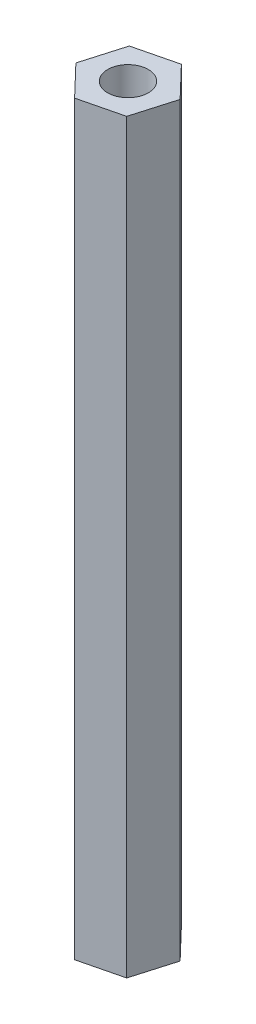
ISO-10303-21;
HEADER;
FILE_DESCRIPTION(('STEP AP214'),'2;1');
FILE_NAME('part.step','',(''),(''),'','','');
FILE_SCHEMA(('AUTOMOTIVE_DESIGN { 1 0 10303 214 1 1 1 1 }'));
ENDSEC;
DATA;
#1=APPLICATION_CONTEXT('core data for automotive mechanical design processes');
#2=APPLICATION_PROTOCOL_DEFINITION('international standard','automotive_design',2000,#1);
#3=PRODUCT_CONTEXT('',#1,'mechanical');
#4=PRODUCT('Part','Part','',(#3));
#5=PRODUCT_RELATED_PRODUCT_CATEGORY('part','',(#4));
#6=PRODUCT_DEFINITION_FORMATION('','',#4);
#7=PRODUCT_DEFINITION_CONTEXT('part definition',#1,'design');
#8=PRODUCT_DEFINITION('design','',#6,#7);
#9=PRODUCT_DEFINITION_SHAPE('','',#8);
#10=(LENGTH_UNIT() NAMED_UNIT(*) SI_UNIT(.MILLI.,.METRE.));
#11=(NAMED_UNIT(*) PLANE_ANGLE_UNIT() SI_UNIT($,.RADIAN.));
#12=(NAMED_UNIT(*) SI_UNIT($,.STERADIAN.) SOLID_ANGLE_UNIT());
#13=UNCERTAINTY_MEASURE_WITH_UNIT(LENGTH_MEASURE(1.E-05),#10,'distance_accuracy_value','');
#14=(GEOMETRIC_REPRESENTATION_CONTEXT(3) GLOBAL_UNCERTAINTY_ASSIGNED_CONTEXT((#13)) GLOBAL_UNIT_ASSIGNED_CONTEXT((#10,
#11,#12)) REPRESENTATION_CONTEXT('',''));
#15=CARTESIAN_POINT('',(0.,0.,0.));
#16=DIRECTION('',(0.,0.,1.));
#17=DIRECTION('',(1.,0.,0.));
#18=AXIS2_PLACEMENT_3D('',#15,#16,#17);
#19=CARTESIAN_POINT('',(-6.32811130994487,63.5,-2.46052037020981));
#20=DIRECTION('',(-0.238502387947703,0.,-0.971141910815944));
#21=DIRECTION('',(-0.971141910815944,0.,0.238502387947703));
#22=AXIS2_PLACEMENT_3D('',#19,#20,#21);
#23=PLANE('',#22);
#24=DIRECTION('',(0.971141910815944,0.,-0.238502387947703));
#25=VECTOR('',#24,1.);
#26=CARTESIAN_POINT('',(-6.32811130994487,0.,-2.46052037020981));
#27=LINE('',#26,#25);
#28=CARTESIAN_POINT('',(-6.32811130994487,0.,-2.46052037020981));
#29=VERTEX_POINT('',#28);
#30=CARTESIAN_POINT('',(-2.76773588288857,0.,-3.33491167377304));
#31=VERTEX_POINT('',#30);
#32=EDGE_CURVE('E122',#29,#31,#27,.T.);
#33=ORIENTED_EDGE('',*,*,#32,.T.);
#34=DIRECTION('',(0.,-1.,0.));
#35=VECTOR('',#34,1.);
#36=CARTESIAN_POINT('',(-2.76773588288857,63.5,-3.33491167377304));
#37=LINE('',#36,#35);
#38=CARTESIAN_POINT('',(-2.76773588288857,63.5,-3.33491167377304));
#39=VERTEX_POINT('',#38);
#40=EDGE_CURVE('E11',#39,#31,#37,.T.);
#41=ORIENTED_EDGE('',*,*,#40,.F.);
#42=DIRECTION('',(0.971141910815944,0.,-0.238502387947703));
#43=VECTOR('',#42,1.);
#44=CARTESIAN_POINT('',(-6.32811130994487,63.5,-2.46052037020981));
#45=LINE('',#44,#43);
#46=CARTESIAN_POINT('',(-6.32811130994487,63.5,-2.46052037020981));
#47=VERTEX_POINT('',#46);
#48=EDGE_CURVE('E133',#47,#39,#45,.T.);
#49=ORIENTED_EDGE('',*,*,#48,.F.);
#50=DIRECTION('',(0.,-1.,0.));
#51=VECTOR('',#50,1.);
#52=CARTESIAN_POINT('',(-6.32811130994487,63.5,-2.46052037020981));
#53=LINE('',#52,#51);
#54=EDGE_CURVE('E118',#47,#29,#53,.T.);
#55=ORIENTED_EDGE('',*,*,#54,.T.);
#56=EDGE_LOOP('',(#33,#41,#49,#55));
#57=FACE_BOUND('',#56,.T.);
#58=ADVANCED_FACE('F38',(#57),#23,.F.);
#59=CARTESIAN_POINT('',(-2.76773588288857,63.5,-3.33491167377304));
#60=DIRECTION('',(-0.960284759420221,0.,-0.279021828582011));
#61=DIRECTION('',(-0.279021828582011,0.,0.960284759420221));
#62=AXIS2_PLACEMENT_3D('',#59,#60,#61);
#63=PLANE('',#62);
#64=DIRECTION('',(0.279021828582011,0.,-0.960284759420221));
#65=VECTOR('',#64,1.);
#66=CARTESIAN_POINT('',(-2.76773588288857,0.,-3.33491167377304));
#67=LINE('',#66,#65);
#68=CARTESIAN_POINT('',(-1.74479325109438,0.,-6.85548289239529));
#69=VERTEX_POINT('',#68);
#70=EDGE_CURVE('E125',#31,#69,#67,.T.);
#71=ORIENTED_EDGE('',*,*,#70,.T.);
#72=DIRECTION('',(0.,-1.,0.));
#73=VECTOR('',#72,1.);
#74=CARTESIAN_POINT('',(-1.74479325109438,63.5,-6.85548289239529));
#75=LINE('',#74,#73);
#76=CARTESIAN_POINT('',(-1.74479325109438,63.5,-6.85548289239529));
#77=VERTEX_POINT('',#76);
#78=EDGE_CURVE('E46',#77,#69,#75,.T.);
#79=ORIENTED_EDGE('',*,*,#78,.F.);
#80=DIRECTION('',(0.279021828582011,0.,-0.960284759420221));
#81=VECTOR('',#80,1.);
#82=CARTESIAN_POINT('',(-2.76773588288857,63.5,-3.33491167377304));
#83=LINE('',#82,#81);
#84=EDGE_CURVE('E91',#39,#77,#83,.T.);
#85=ORIENTED_EDGE('',*,*,#84,.F.);
#86=ORIENTED_EDGE('',*,*,#40,.T.);
#87=EDGE_LOOP('',(#71,#79,#85,#86));
#88=FACE_BOUND('',#87,.T.);
#89=ADVANCED_FACE('F158',(#88),#63,.F.);
#90=CARTESIAN_POINT('',(-1.74479325109438,63.5,-6.85548289239529));
#91=DIRECTION('',(-0.721782371472518,0.,0.692120082233934));
#92=DIRECTION('',(0.692120082233934,0.,0.721782371472518));
#93=AXIS2_PLACEMENT_3D('',#90,#91,#92);
#94=PLANE('',#93);
#95=DIRECTION('',(-0.692120082233934,0.,-0.721782371472518));
#96=VECTOR('',#95,1.);
#97=CARTESIAN_POINT('',(-1.74479325109438,0.,-6.85548289239529));
#98=LINE('',#97,#96);
#99=CARTESIAN_POINT('',(-4.28222604635648,0.,-9.50166280745429));
#100=VERTEX_POINT('',#99);
#101=EDGE_CURVE('E128',#69,#100,#98,.T.);
#102=ORIENTED_EDGE('',*,*,#101,.T.);
#103=DIRECTION('',(0.,-1.,0.));
#104=VECTOR('',#103,1.);
#105=CARTESIAN_POINT('',(-4.28222604635648,63.5,-9.50166280745429));
#106=LINE('',#105,#104);
#107=CARTESIAN_POINT('',(-4.28222604635648,63.5,-9.50166280745429));
#108=VERTEX_POINT('',#107);
#109=EDGE_CURVE('E113',#108,#100,#106,.T.);
#110=ORIENTED_EDGE('',*,*,#109,.F.);
#111=DIRECTION('',(-0.692120082233934,0.,-0.721782371472518));
#112=VECTOR('',#111,1.);
#113=CARTESIAN_POINT('',(-1.74479325109438,63.5,-6.85548289239529));
#114=LINE('',#113,#112);
#115=EDGE_CURVE('E104',#77,#108,#114,.T.);
#116=ORIENTED_EDGE('',*,*,#115,.F.);
#117=ORIENTED_EDGE('',*,*,#78,.T.);
#118=EDGE_LOOP('',(#102,#110,#116,#117));
#119=FACE_BOUND('',#118,.T.);
#120=ADVANCED_FACE('F139',(#119),#94,.F.);
#121=CARTESIAN_POINT('',(-4.28222604635648,63.5,-9.50166280745429));
#122=DIRECTION('',(0.238502387947701,0.,0.971141910815944));
#123=DIRECTION('',(0.971141910815945,0.,-0.238502387947701));
#124=AXIS2_PLACEMENT_3D('',#121,#122,#123);
#125=PLANE('',#124);
#126=DIRECTION('',(-0.971141910815945,0.,0.238502387947701));
#127=VECTOR('',#126,1.);
#128=CARTESIAN_POINT('',(-4.28222604635648,0.,-9.50166280745429));
#129=LINE('',#128,#127);
#130=CARTESIAN_POINT('',(-7.84260147341278,0.,-8.62727150389105));
#131=VERTEX_POINT('',#130);
#132=EDGE_CURVE('E112',#100,#131,#129,.T.);
#133=ORIENTED_EDGE('',*,*,#132,.T.);
#134=DIRECTION('',(0.,-1.,0.));
#135=VECTOR('',#134,1.);
#136=CARTESIAN_POINT('',(-7.84260147341278,63.5,-8.62727150389105));
#137=LINE('',#136,#135);
#138=CARTESIAN_POINT('',(-7.84260147341278,63.5,-8.62727150389105));
#139=VERTEX_POINT('',#138);
#140=EDGE_CURVE('E109',#139,#131,#137,.T.);
#141=ORIENTED_EDGE('',*,*,#140,.F.);
#142=DIRECTION('',(-0.971141910815945,0.,0.238502387947701));
#143=VECTOR('',#142,1.);
#144=CARTESIAN_POINT('',(-4.28222604635648,63.5,-9.50166280745429));
#145=LINE('',#144,#143);
#146=EDGE_CURVE('E98',#108,#139,#145,.T.);
#147=ORIENTED_EDGE('',*,*,#146,.F.);
#148=ORIENTED_EDGE('',*,*,#109,.T.);
#149=EDGE_LOOP('',(#133,#141,#147,#148));
#150=FACE_BOUND('',#149,.T.);
#151=ADVANCED_FACE('F110',(#150),#125,.F.);
#152=CARTESIAN_POINT('',(-7.84260147341278,63.5,-8.62727150389105));
#153=DIRECTION('',(0.960284759420221,0.,0.27902182858201));
#154=DIRECTION('',(0.27902182858201,0.,-0.960284759420221));
#155=AXIS2_PLACEMENT_3D('',#152,#153,#154);
#156=PLANE('',#155);
#157=DIRECTION('',(-0.27902182858201,0.,0.960284759420221));
#158=VECTOR('',#157,1.);
#159=CARTESIAN_POINT('',(-7.84260147341278,0.,-8.62727150389105));
#160=LINE('',#159,#158);
#161=CARTESIAN_POINT('',(-8.86554410520697,0.,-5.10670028526881));
#162=VERTEX_POINT('',#161);
#163=EDGE_CURVE('E77',#131,#162,#160,.T.);
#164=ORIENTED_EDGE('',*,*,#163,.T.);
#165=DIRECTION('',(0.,-1.,0.));
#166=VECTOR('',#165,1.);
#167=CARTESIAN_POINT('',(-8.86554410520697,63.5,-5.10670028526881));
#168=LINE('',#167,#166);
#169=CARTESIAN_POINT('',(-8.86554410520697,63.5,-5.10670028526881));
#170=VERTEX_POINT('',#169);
#171=EDGE_CURVE('E114',#170,#162,#168,.T.);
#172=ORIENTED_EDGE('',*,*,#171,.F.);
#173=DIRECTION('',(-0.27902182858201,0.,0.960284759420221));
#174=VECTOR('',#173,1.);
#175=CARTESIAN_POINT('',(-7.84260147341278,63.5,-8.62727150389105));
#176=LINE('',#175,#174);
#177=EDGE_CURVE('E102',#139,#170,#176,.T.);
#178=ORIENTED_EDGE('',*,*,#177,.F.);
#179=ORIENTED_EDGE('',*,*,#140,.T.);
#180=EDGE_LOOP('',(#164,#172,#178,#179));
#181=FACE_BOUND('',#180,.T.);
#182=ADVANCED_FACE('F116',(#181),#156,.F.);
#183=CARTESIAN_POINT('',(-8.86554410520697,63.5,-5.10670028526881));
#184=DIRECTION('',(0.721782371472518,0.,-0.692120082233934));
#185=DIRECTION('',(-0.692120082233934,0.,-0.721782371472518));
#186=AXIS2_PLACEMENT_3D('',#183,#184,#185);
#187=PLANE('',#186);
#188=DIRECTION('',(0.692120082233934,0.,0.721782371472518));
#189=VECTOR('',#188,1.);
#190=CARTESIAN_POINT('',(-8.86554410520697,0.,-5.10670028526881));
#191=LINE('',#190,#189);
#192=EDGE_CURVE('E83',#162,#29,#191,.T.);
#193=ORIENTED_EDGE('',*,*,#192,.T.);
#194=ORIENTED_EDGE('',*,*,#54,.F.);
#195=DIRECTION('',(0.692120082233934,0.,0.721782371472518));
#196=VECTOR('',#195,1.);
#197=CARTESIAN_POINT('',(-8.86554410520697,63.5,-5.10670028526881));
#198=LINE('',#197,#196);
#199=EDGE_CURVE('E54',#170,#47,#198,.T.);
#200=ORIENTED_EDGE('',*,*,#199,.F.);
#201=ORIENTED_EDGE('',*,*,#171,.T.);
#202=EDGE_LOOP('',(#193,#194,#200,#201));
#203=FACE_BOUND('',#202,.T.);
#204=ADVANCED_FACE('F146',(#203),#187,.F.);
#205=CARTESIAN_POINT('',(0.,63.5,0.));
#206=DIRECTION('',(0.,1.,0.));
#207=DIRECTION('',(0.,0.,1.));
#208=AXIS2_PLACEMENT_3D('',#205,#206,#207);
#209=PLANE('',#208);
#210=CARTESIAN_POINT('',(-5.30516867815067,63.5,-5.98109158883205));
#211=DIRECTION('',(0.,1.,0.));
#212=DIRECTION('',(0.,0.,1.));
#213=AXIS2_PLACEMENT_3D('',#210,#211,#212);
#214=CIRCLE('',#213,1.7272);
#215=CARTESIAN_POINT('',(-5.30516867815067,63.5,-4.25389158883205));
#216=VERTEX_POINT('',#215);
#217=EDGE_CURVE('E279',#216,#216,#214,.T.);
#218=ORIENTED_EDGE('',*,*,#217,.F.);
#219=EDGE_LOOP('',(#218));
#220=FACE_BOUND('',#219,.T.);
#221=ORIENTED_EDGE('',*,*,#48,.T.);
#222=ORIENTED_EDGE('',*,*,#84,.T.);
#223=ORIENTED_EDGE('',*,*,#115,.T.);
#224=ORIENTED_EDGE('',*,*,#146,.T.);
#225=ORIENTED_EDGE('',*,*,#177,.T.);
#226=ORIENTED_EDGE('',*,*,#199,.T.);
#227=EDGE_LOOP('',(#221,#222,#223,#224,#225,#226));
#228=FACE_BOUND('',#227,.T.);
#229=ADVANCED_FACE('F100',(#220,#228),#209,.T.);
#230=CARTESIAN_POINT('',(0.,0.,0.));
#231=DIRECTION('',(0.,1.,0.));
#232=DIRECTION('',(0.,0.,1.));
#233=AXIS2_PLACEMENT_3D('',#230,#231,#232);
#234=PLANE('',#233);
#235=CARTESIAN_POINT('',(-5.30516867815067,0.,-5.98109158883205));
#236=DIRECTION('',(0.,-1.,0.));
#237=DIRECTION('',(0.,0.,-1.));
#238=AXIS2_PLACEMENT_3D('',#235,#236,#237);
#239=CIRCLE('',#238,1.7272);
#240=CARTESIAN_POINT('',(-5.30516867815067,0.,-7.70829158883205));
#241=VERTEX_POINT('',#240);
#242=EDGE_CURVE('E280',#241,#241,#239,.T.);
#243=ORIENTED_EDGE('',*,*,#242,.F.);
#244=EDGE_LOOP('',(#243));
#245=FACE_BOUND('',#244,.T.);
#246=ORIENTED_EDGE('',*,*,#32,.F.);
#247=ORIENTED_EDGE('',*,*,#192,.F.);
#248=ORIENTED_EDGE('',*,*,#163,.F.);
#249=ORIENTED_EDGE('',*,*,#132,.F.);
#250=ORIENTED_EDGE('',*,*,#101,.F.);
#251=ORIENTED_EDGE('',*,*,#70,.F.);
#252=EDGE_LOOP('',(#246,#247,#248,#249,#250,#251));
#253=FACE_BOUND('',#252,.T.);
#254=ADVANCED_FACE('F142',(#245,#253),#234,.F.);
#255=CARTESIAN_POINT('',(-5.30516867815067,53.975,-5.98109158883205));
#256=DIRECTION('',(0.,1.,0.));
#257=DIRECTION('',(0.,0.,1.));
#258=AXIS2_PLACEMENT_3D('',#255,#256,#257);
#259=CYLINDRICAL_SURFACE('',#258,1.7272);
#260=CARTESIAN_POINT('',(-5.30516867815067,53.975,-5.98109158883205));
#261=DIRECTION('',(0.,1.,0.));
#262=DIRECTION('',(0.,0.,1.));
#263=AXIS2_PLACEMENT_3D('',#260,#261,#262);
#264=CIRCLE('',#263,1.7272);
#265=CARTESIAN_POINT('',(-5.30516867815067,53.975,-4.25389158883205));
#266=VERTEX_POINT('',#265);
#267=EDGE_CURVE('E126',#266,#266,#264,.T.);
#268=ORIENTED_EDGE('',*,*,#267,.F.);
#269=EDGE_LOOP('',(#268));
#270=FACE_BOUND('',#269,.T.);
#271=ORIENTED_EDGE('',*,*,#217,.T.);
#272=EDGE_LOOP('',(#271));
#273=FACE_BOUND('',#272,.T.);
#274=ADVANCED_FACE('F196',(#270,#273),#259,.F.);
#275=CARTESIAN_POINT('',(-5.30516867815067,53.975,-5.98109158883205));
#276=DIRECTION('',(0.,1.,0.));
#277=DIRECTION('',(0.,0.,1.));
#278=AXIS2_PLACEMENT_3D('',#275,#276,#277);
#279=PLANE('',#278);
#280=ORIENTED_EDGE('',*,*,#267,.T.);
#281=EDGE_LOOP('',(#280));
#282=FACE_BOUND('',#281,.T.);
#283=ADVANCED_FACE('F206',(#282),#279,.T.);
#284=CARTESIAN_POINT('',(-5.30516867815067,9.525,-5.98109158883205));
#285=DIRECTION('',(0.,-1.,0.));
#286=DIRECTION('',(0.,0.,-1.));
#287=AXIS2_PLACEMENT_3D('',#284,#285,#286);
#288=CYLINDRICAL_SURFACE('',#287,1.7272);
#289=CARTESIAN_POINT('',(-5.30516867815067,9.525,-5.98109158883205));
#290=DIRECTION('',(0.,-1.,0.));
#291=DIRECTION('',(0.,0.,-1.));
#292=AXIS2_PLACEMENT_3D('',#289,#290,#291);
#293=CIRCLE('',#292,1.7272);
#294=CARTESIAN_POINT('',(-5.30516867815067,9.525,-7.70829158883205));
#295=VERTEX_POINT('',#294);
#296=EDGE_CURVE('E278',#295,#295,#293,.T.);
#297=ORIENTED_EDGE('',*,*,#296,.F.);
#298=EDGE_LOOP('',(#297));
#299=FACE_BOUND('',#298,.T.);
#300=ORIENTED_EDGE('',*,*,#242,.T.);
#301=EDGE_LOOP('',(#300));
#302=FACE_BOUND('',#301,.T.);
#303=ADVANCED_FACE('F215',(#299,#302),#288,.F.);
#304=CARTESIAN_POINT('',(-5.30516867815067,9.525,-5.98109158883205));
#305=DIRECTION('',(0.,-1.,0.));
#306=DIRECTION('',(0.,0.,-1.));
#307=AXIS2_PLACEMENT_3D('',#304,#305,#306);
#308=PLANE('',#307);
#309=ORIENTED_EDGE('',*,*,#296,.T.);
#310=EDGE_LOOP('',(#309));
#311=FACE_BOUND('',#310,.T.);
#312=ADVANCED_FACE('F224',(#311),#308,.T.);
#313=CLOSED_SHELL('',(#58,#89,#120,#151,#182,#204,#229,#254,#274,#283,#303,#312));
#314=MANIFOLD_SOLID_BREP('B2',#313);
#315=ADVANCED_BREP_SHAPE_REPRESENTATION('',(#18,#314),#14);
#316=SHAPE_DEFINITION_REPRESENTATION(#9,#315);
ENDSEC;
END-ISO-10303-21;
